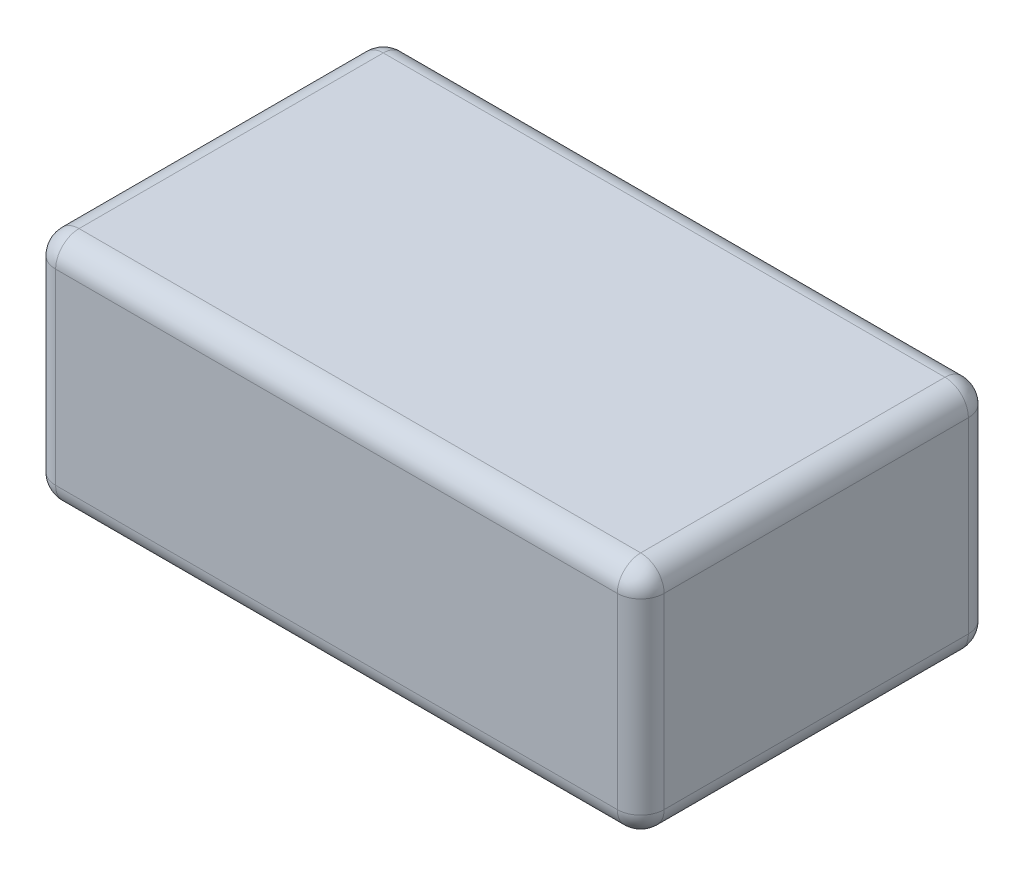
ISO-10303-21;
HEADER;
FILE_DESCRIPTION(('STEP AP214'),'2;1');
FILE_NAME('part.step','',(''),(''),'','','');
FILE_SCHEMA(('AUTOMOTIVE_DESIGN { 1 0 10303 214 1 1 1 1 }'));
ENDSEC;
DATA;
#1=APPLICATION_CONTEXT('core data for automotive mechanical design processes');
#2=APPLICATION_PROTOCOL_DEFINITION('international standard','automotive_design',2000,#1);
#3=PRODUCT_CONTEXT('',#1,'mechanical');
#4=PRODUCT('Part','Part','',(#3));
#5=PRODUCT_RELATED_PRODUCT_CATEGORY('part','',(#4));
#6=PRODUCT_DEFINITION_FORMATION('','',#4);
#7=PRODUCT_DEFINITION_CONTEXT('part definition',#1,'design');
#8=PRODUCT_DEFINITION('design','',#6,#7);
#9=PRODUCT_DEFINITION_SHAPE('','',#8);
#10=(LENGTH_UNIT() NAMED_UNIT(*) SI_UNIT(.MILLI.,.METRE.));
#11=(NAMED_UNIT(*) PLANE_ANGLE_UNIT() SI_UNIT($,.RADIAN.));
#12=(NAMED_UNIT(*) SI_UNIT($,.STERADIAN.) SOLID_ANGLE_UNIT());
#13=UNCERTAINTY_MEASURE_WITH_UNIT(LENGTH_MEASURE(1.E-05),#10,'distance_accuracy_value','');
#14=(GEOMETRIC_REPRESENTATION_CONTEXT(3) GLOBAL_UNCERTAINTY_ASSIGNED_CONTEXT((#13)) GLOBAL_UNIT_ASSIGNED_CONTEXT((#10,
#11,#12)) REPRESENTATION_CONTEXT('',''));
#15=CARTESIAN_POINT('',(0.,0.,0.));
#16=DIRECTION('',(0.,0.,1.));
#17=DIRECTION('',(1.,0.,0.));
#18=AXIS2_PLACEMENT_3D('',#15,#16,#17);
#19=CARTESIAN_POINT('',(26.,20.,15.));
#20=DIRECTION('',(-1.,0.,0.));
#21=DIRECTION('',(0.,0.,1.));
#22=AXIS2_PLACEMENT_3D('',#19,#20,#21);
#23=PLANE('',#22);
#24=DIRECTION('',(0.,0.,-1.));
#25=VECTOR('',#24,1.);
#26=CARTESIAN_POINT('',(26.,18.,15.));
#27=LINE('',#26,#25);
#28=CARTESIAN_POINT('',(26.,18.,-13.));
#29=VERTEX_POINT('',#28);
#30=CARTESIAN_POINT('',(26.,18.,13.));
#31=VERTEX_POINT('',#30);
#32=EDGE_CURVE('E178',#29,#31,#27,.F.);
#33=ORIENTED_EDGE('',*,*,#32,.T.);
#34=DIRECTION('',(0.,-1.,0.));
#35=VECTOR('',#34,1.);
#36=CARTESIAN_POINT('',(26.,20.,13.));
#37=LINE('',#36,#35);
#38=CARTESIAN_POINT('',(26.,2.,13.));
#39=VERTEX_POINT('',#38);
#40=EDGE_CURVE('E183',#31,#39,#37,.T.);
#41=ORIENTED_EDGE('',*,*,#40,.T.);
#42=DIRECTION('',(0.,0.,-1.));
#43=VECTOR('',#42,1.);
#44=CARTESIAN_POINT('',(26.,2.,-15.));
#45=LINE('',#44,#43);
#46=CARTESIAN_POINT('',(26.,2.,-13.));
#47=VERTEX_POINT('',#46);
#48=EDGE_CURVE('E180',#39,#47,#45,.T.);
#49=ORIENTED_EDGE('',*,*,#48,.T.);
#50=DIRECTION('',(0.,-1.,0.));
#51=VECTOR('',#50,1.);
#52=CARTESIAN_POINT('',(26.,20.,-13.));
#53=LINE('',#52,#51);
#54=EDGE_CURVE('E176',#47,#29,#53,.F.);
#55=ORIENTED_EDGE('',*,*,#54,.T.);
#56=EDGE_LOOP('',(#33,#41,#49,#55));
#57=FACE_BOUND('',#56,.T.);
#58=ADVANCED_FACE('F33',(#57),#23,.F.);
#59=CARTESIAN_POINT('',(-26.,20.,-15.));
#60=DIRECTION('',(0.,0.,1.));
#61=DIRECTION('',(1.,0.,0.));
#62=AXIS2_PLACEMENT_3D('',#59,#60,#61);
#63=PLANE('',#62);
#64=DIRECTION('',(0.,-1.,0.));
#65=VECTOR('',#64,1.);
#66=CARTESIAN_POINT('',(24.,20.,-15.));
#67=LINE('',#66,#65);
#68=CARTESIAN_POINT('',(24.,18.,-15.));
#69=VERTEX_POINT('',#68);
#70=CARTESIAN_POINT('',(24.,2.,-15.));
#71=VERTEX_POINT('',#70);
#72=EDGE_CURVE('E128',#69,#71,#67,.T.);
#73=ORIENTED_EDGE('',*,*,#72,.T.);
#74=DIRECTION('',(-1.,0.,0.));
#75=VECTOR('',#74,1.);
#76=CARTESIAN_POINT('',(-26.,2.,-15.));
#77=LINE('',#76,#75);
#78=CARTESIAN_POINT('',(-24.,2.,-15.));
#79=VERTEX_POINT('',#78);
#80=EDGE_CURVE('E156',#71,#79,#77,.T.);
#81=ORIENTED_EDGE('',*,*,#80,.T.);
#82=DIRECTION('',(0.,-1.,0.));
#83=VECTOR('',#82,1.);
#84=CARTESIAN_POINT('',(-24.,20.,-15.));
#85=LINE('',#84,#83);
#86=CARTESIAN_POINT('',(-24.,18.,-15.));
#87=VERTEX_POINT('',#86);
#88=EDGE_CURVE('E131',#79,#87,#85,.F.);
#89=ORIENTED_EDGE('',*,*,#88,.T.);
#90=DIRECTION('',(-1.,0.,0.));
#91=VECTOR('',#90,1.);
#92=CARTESIAN_POINT('',(-26.,18.,-15.));
#93=LINE('',#92,#91);
#94=EDGE_CURVE('E124',#87,#69,#93,.F.);
#95=ORIENTED_EDGE('',*,*,#94,.T.);
#96=EDGE_LOOP('',(#73,#81,#89,#95));
#97=FACE_BOUND('',#96,.T.);
#98=ADVANCED_FACE('F125',(#97),#63,.F.);
#99=CARTESIAN_POINT('',(-26.,20.,15.));
#100=DIRECTION('',(1.,0.,0.));
#101=DIRECTION('',(0.,0.,-1.));
#102=AXIS2_PLACEMENT_3D('',#99,#100,#101);
#103=PLANE('',#102);
#104=DIRECTION('',(0.,0.,1.));
#105=VECTOR('',#104,1.);
#106=CARTESIAN_POINT('',(-26.,18.,15.));
#107=LINE('',#106,#105);
#108=CARTESIAN_POINT('',(-26.,18.,13.));
#109=VERTEX_POINT('',#108);
#110=CARTESIAN_POINT('',(-26.,18.,-13.));
#111=VERTEX_POINT('',#110);
#112=EDGE_CURVE('E169',#109,#111,#107,.F.);
#113=ORIENTED_EDGE('',*,*,#112,.T.);
#114=DIRECTION('',(0.,-1.,0.));
#115=VECTOR('',#114,1.);
#116=CARTESIAN_POINT('',(-26.,20.,-13.));
#117=LINE('',#116,#115);
#118=CARTESIAN_POINT('',(-26.,2.,-13.));
#119=VERTEX_POINT('',#118);
#120=EDGE_CURVE('E173',#111,#119,#117,.T.);
#121=ORIENTED_EDGE('',*,*,#120,.T.);
#122=DIRECTION('',(0.,0.,1.));
#123=VECTOR('',#122,1.);
#124=CARTESIAN_POINT('',(-26.,2.,15.));
#125=LINE('',#124,#123);
#126=CARTESIAN_POINT('',(-26.,2.,13.));
#127=VERTEX_POINT('',#126);
#128=EDGE_CURVE('E171',#119,#127,#125,.T.);
#129=ORIENTED_EDGE('',*,*,#128,.T.);
#130=DIRECTION('',(0.,-1.,0.));
#131=VECTOR('',#130,1.);
#132=CARTESIAN_POINT('',(-26.,20.,13.));
#133=LINE('',#132,#131);
#134=EDGE_CURVE('E167',#127,#109,#133,.F.);
#135=ORIENTED_EDGE('',*,*,#134,.T.);
#136=EDGE_LOOP('',(#113,#121,#129,#135));
#137=FACE_BOUND('',#136,.T.);
#138=ADVANCED_FACE('F262',(#137),#103,.F.);
#139=CARTESIAN_POINT('',(-26.,20.,15.));
#140=DIRECTION('',(0.,0.,-1.));
#141=DIRECTION('',(-1.,0.,0.));
#142=AXIS2_PLACEMENT_3D('',#139,#140,#141);
#143=PLANE('',#142);
#144=DIRECTION('',(1.,0.,0.));
#145=VECTOR('',#144,1.);
#146=CARTESIAN_POINT('',(26.,2.,15.));
#147=LINE('',#146,#145);
#148=CARTESIAN_POINT('',(-24.,2.,15.));
#149=VERTEX_POINT('',#148);
#150=CARTESIAN_POINT('',(24.,2.,15.));
#151=VERTEX_POINT('',#150);
#152=EDGE_CURVE('E189',#149,#151,#147,.T.);
#153=ORIENTED_EDGE('',*,*,#152,.T.);
#154=DIRECTION('',(0.,-1.,0.));
#155=VECTOR('',#154,1.);
#156=CARTESIAN_POINT('',(24.,20.,15.));
#157=LINE('',#156,#155);
#158=CARTESIAN_POINT('',(24.,18.,15.));
#159=VERTEX_POINT('',#158);
#160=EDGE_CURVE('E192',#151,#159,#157,.F.);
#161=ORIENTED_EDGE('',*,*,#160,.T.);
#162=DIRECTION('',(1.,0.,0.));
#163=VECTOR('',#162,1.);
#164=CARTESIAN_POINT('',(-26.,18.,15.));
#165=LINE('',#164,#163);
#166=CARTESIAN_POINT('',(-24.,18.,15.));
#167=VERTEX_POINT('',#166);
#168=EDGE_CURVE('E187',#159,#167,#165,.F.);
#169=ORIENTED_EDGE('',*,*,#168,.T.);
#170=DIRECTION('',(0.,-1.,0.));
#171=VECTOR('',#170,1.);
#172=CARTESIAN_POINT('',(-24.,20.,15.));
#173=LINE('',#172,#171);
#174=EDGE_CURVE('E185',#167,#149,#173,.T.);
#175=ORIENTED_EDGE('',*,*,#174,.T.);
#176=EDGE_LOOP('',(#153,#161,#169,#175));
#177=FACE_BOUND('',#176,.T.);
#178=ADVANCED_FACE('F271',(#177),#143,.F.);
#179=CARTESIAN_POINT('',(0.,20.,0.));
#180=DIRECTION('',(0.,-1.,0.));
#181=DIRECTION('',(0.,0.,-1.));
#182=AXIS2_PLACEMENT_3D('',#179,#180,#181);
#183=PLANE('',#182);
#184=DIRECTION('',(1.,0.,0.));
#185=VECTOR('',#184,1.);
#186=CARTESIAN_POINT('',(0.,20.,13.));
#187=LINE('',#186,#185);
#188=CARTESIAN_POINT('',(-24.,20.,13.));
#189=VERTEX_POINT('',#188);
#190=CARTESIAN_POINT('',(24.,20.,13.));
#191=VERTEX_POINT('',#190);
#192=EDGE_CURVE('E194',#189,#191,#187,.T.);
#193=ORIENTED_EDGE('',*,*,#192,.T.);
#194=DIRECTION('',(0.,0.,-1.));
#195=VECTOR('',#194,1.);
#196=CARTESIAN_POINT('',(24.,20.,0.));
#197=LINE('',#196,#195);
#198=CARTESIAN_POINT('',(24.,20.,-13.));
#199=VERTEX_POINT('',#198);
#200=EDGE_CURVE('E11',#191,#199,#197,.T.);
#201=ORIENTED_EDGE('',*,*,#200,.T.);
#202=DIRECTION('',(-1.,0.,0.));
#203=VECTOR('',#202,1.);
#204=CARTESIAN_POINT('',(0.,20.,-13.));
#205=LINE('',#204,#203);
#206=CARTESIAN_POINT('',(-24.,20.,-13.));
#207=VERTEX_POINT('',#206);
#208=EDGE_CURVE('E42',#199,#207,#205,.T.);
#209=ORIENTED_EDGE('',*,*,#208,.T.);
#210=DIRECTION('',(0.,0.,1.));
#211=VECTOR('',#210,1.);
#212=CARTESIAN_POINT('',(-24.,20.,0.));
#213=LINE('',#212,#211);
#214=EDGE_CURVE('E196',#207,#189,#213,.T.);
#215=ORIENTED_EDGE('',*,*,#214,.T.);
#216=EDGE_LOOP('',(#193,#201,#209,#215));
#217=FACE_BOUND('',#216,.T.);
#218=ADVANCED_FACE('F294',(#217),#183,.F.);
#219=CARTESIAN_POINT('',(0.,0.,0.));
#220=DIRECTION('',(0.,-1.,0.));
#221=DIRECTION('',(0.,0.,-1.));
#222=AXIS2_PLACEMENT_3D('',#219,#220,#221);
#223=PLANE('',#222);
#224=DIRECTION('',(0.,0.,1.));
#225=VECTOR('',#224,1.);
#226=CARTESIAN_POINT('',(-24.,0.,-15.));
#227=LINE('',#226,#225);
#228=CARTESIAN_POINT('',(-24.,0.,13.));
#229=VERTEX_POINT('',#228);
#230=CARTESIAN_POINT('',(-24.,0.,-13.));
#231=VERTEX_POINT('',#230);
#232=EDGE_CURVE('E162',#229,#231,#227,.F.);
#233=ORIENTED_EDGE('',*,*,#232,.T.);
#234=DIRECTION('',(-1.,0.,0.));
#235=VECTOR('',#234,1.);
#236=CARTESIAN_POINT('',(26.,0.,-13.));
#237=LINE('',#236,#235);
#238=CARTESIAN_POINT('',(24.,0.,-13.));
#239=VERTEX_POINT('',#238);
#240=EDGE_CURVE('E164',#231,#239,#237,.F.);
#241=ORIENTED_EDGE('',*,*,#240,.T.);
#242=DIRECTION('',(0.,0.,-1.));
#243=VECTOR('',#242,1.);
#244=CARTESIAN_POINT('',(24.,0.,15.));
#245=LINE('',#244,#243);
#246=CARTESIAN_POINT('',(24.,0.,13.));
#247=VERTEX_POINT('',#246);
#248=EDGE_CURVE('E160',#239,#247,#245,.F.);
#249=ORIENTED_EDGE('',*,*,#248,.T.);
#250=DIRECTION('',(1.,0.,0.));
#251=VECTOR('',#250,1.);
#252=CARTESIAN_POINT('',(-26.,0.,13.));
#253=LINE('',#252,#251);
#254=EDGE_CURVE('E158',#247,#229,#253,.F.);
#255=ORIENTED_EDGE('',*,*,#254,.T.);
#256=EDGE_LOOP('',(#233,#241,#249,#255));
#257=FACE_BOUND('',#256,.T.);
#258=ADVANCED_FACE('F296',(#257),#223,.T.);
#259=CARTESIAN_POINT('',(0.,18.,13.));
#260=DIRECTION('',(1.,0.,0.));
#261=DIRECTION('',(0.,0.,-1.));
#262=AXIS2_PLACEMENT_3D('',#259,#260,#261);
#263=CYLINDRICAL_SURFACE('',#262,2.);
#264=CARTESIAN_POINT('',(24.,18.,13.));
#265=DIRECTION('',(1.,0.,0.));
#266=DIRECTION('',(0.,0.,-1.));
#267=AXIS2_PLACEMENT_3D('',#264,#265,#266);
#268=CIRCLE('',#267,2.);
#269=EDGE_CURVE('E37',#191,#159,#268,.T.);
#270=ORIENTED_EDGE('',*,*,#269,.F.);
#271=ORIENTED_EDGE('',*,*,#192,.F.);
#272=CARTESIAN_POINT('',(-24.,18.,13.));
#273=DIRECTION('',(-1.,0.,0.));
#274=DIRECTION('',(0.,0.,1.));
#275=AXIS2_PLACEMENT_3D('',#272,#273,#274);
#276=CIRCLE('',#275,2.);
#277=EDGE_CURVE('E153',#167,#189,#276,.T.);
#278=ORIENTED_EDGE('',*,*,#277,.F.);
#279=ORIENTED_EDGE('',*,*,#168,.F.);
#280=EDGE_LOOP('',(#270,#271,#278,#279));
#281=FACE_BOUND('',#280,.T.);
#282=ADVANCED_FACE('F35',(#281),#263,.T.);
#283=CARTESIAN_POINT('',(24.,18.,13.));
#284=DIRECTION('',(0.,0.,1.));
#285=DIRECTION('',(1.,0.,0.));
#286=AXIS2_PLACEMENT_3D('',#283,#284,#285);
#287=SPHERICAL_SURFACE('',#286,2.);
#288=CARTESIAN_POINT('',(24.,18.,13.));
#289=DIRECTION('',(0.,0.,1.));
#290=DIRECTION('',(1.,0.,0.));
#291=AXIS2_PLACEMENT_3D('',#288,#289,#290);
#292=CIRCLE('',#291,2.);
#293=EDGE_CURVE('E241',#191,#31,#292,.F.);
#294=ORIENTED_EDGE('',*,*,#293,.F.);
#295=ORIENTED_EDGE('',*,*,#269,.T.);
#296=CARTESIAN_POINT('',(24.,18.,13.));
#297=DIRECTION('',(0.,1.,0.));
#298=DIRECTION('',(0.,0.,1.));
#299=AXIS2_PLACEMENT_3D('',#296,#297,#298);
#300=CIRCLE('',#299,2.);
#301=EDGE_CURVE('E244',#31,#159,#300,.F.);
#302=ORIENTED_EDGE('',*,*,#301,.F.);
#303=EDGE_LOOP('',(#294,#295,#302));
#304=FACE_BOUND('',#303,.T.);
#305=ADVANCED_FACE('F289',(#304),#287,.T.);
#306=CARTESIAN_POINT('',(-24.,18.,13.));
#307=DIRECTION('',(0.,0.,1.));
#308=DIRECTION('',(1.,0.,0.));
#309=AXIS2_PLACEMENT_3D('',#306,#307,#308);
#310=SPHERICAL_SURFACE('',#309,2.);
#311=CARTESIAN_POINT('',(-24.,18.,13.));
#312=DIRECTION('',(0.,1.,0.));
#313=DIRECTION('',(0.,0.,1.));
#314=AXIS2_PLACEMENT_3D('',#311,#312,#313);
#315=CIRCLE('',#314,2.);
#316=EDGE_CURVE('E235',#167,#109,#315,.F.);
#317=ORIENTED_EDGE('',*,*,#316,.F.);
#318=ORIENTED_EDGE('',*,*,#277,.T.);
#319=CARTESIAN_POINT('',(-24.,18.,13.));
#320=DIRECTION('',(0.,0.,1.));
#321=DIRECTION('',(1.,0.,0.));
#322=AXIS2_PLACEMENT_3D('',#319,#320,#321);
#323=CIRCLE('',#322,2.);
#324=EDGE_CURVE('E238',#109,#189,#323,.F.);
#325=ORIENTED_EDGE('',*,*,#324,.F.);
#326=EDGE_LOOP('',(#317,#318,#325));
#327=FACE_BOUND('',#326,.T.);
#328=ADVANCED_FACE('F251',(#327),#310,.T.);
#329=CARTESIAN_POINT('',(24.,20.,13.));
#330=DIRECTION('',(0.,-1.,0.));
#331=DIRECTION('',(0.,0.,-1.));
#332=AXIS2_PLACEMENT_3D('',#329,#330,#331);
#333=CYLINDRICAL_SURFACE('',#332,2.);
#334=ORIENTED_EDGE('',*,*,#301,.T.);
#335=ORIENTED_EDGE('',*,*,#160,.F.);
#336=CARTESIAN_POINT('',(24.,2.,13.));
#337=DIRECTION('',(0.,-1.,0.));
#338=DIRECTION('',(0.,0.,-1.));
#339=AXIS2_PLACEMENT_3D('',#336,#337,#338);
#340=CIRCLE('',#339,2.);
#341=EDGE_CURVE('E230',#39,#151,#340,.T.);
#342=ORIENTED_EDGE('',*,*,#341,.F.);
#343=ORIENTED_EDGE('',*,*,#40,.F.);
#344=EDGE_LOOP('',(#334,#335,#342,#343));
#345=FACE_BOUND('',#344,.T.);
#346=ADVANCED_FACE('F283',(#345),#333,.T.);
#347=CARTESIAN_POINT('',(24.,18.,0.));
#348=DIRECTION('',(0.,0.,-1.));
#349=DIRECTION('',(-1.,0.,0.));
#350=AXIS2_PLACEMENT_3D('',#347,#348,#349);
#351=CYLINDRICAL_SURFACE('',#350,2.);
#352=ORIENTED_EDGE('',*,*,#293,.T.);
#353=ORIENTED_EDGE('',*,*,#32,.F.);
#354=CARTESIAN_POINT('',(24.,18.,-13.));
#355=DIRECTION('',(0.,0.,-1.));
#356=DIRECTION('',(-1.,0.,0.));
#357=AXIS2_PLACEMENT_3D('',#354,#355,#356);
#358=CIRCLE('',#357,2.);
#359=EDGE_CURVE('E137',#199,#29,#358,.T.);
#360=ORIENTED_EDGE('',*,*,#359,.F.);
#361=ORIENTED_EDGE('',*,*,#200,.F.);
#362=EDGE_LOOP('',(#352,#353,#360,#361));
#363=FACE_BOUND('',#362,.T.);
#364=ADVANCED_FACE('F293',(#363),#351,.T.);
#365=CARTESIAN_POINT('',(0.,18.,-13.));
#366=DIRECTION('',(-1.,0.,0.));
#367=DIRECTION('',(0.,0.,1.));
#368=AXIS2_PLACEMENT_3D('',#365,#366,#367);
#369=CYLINDRICAL_SURFACE('',#368,2.);
#370=CARTESIAN_POINT('',(-24.,18.,-13.));
#371=DIRECTION('',(-1.,0.,0.));
#372=DIRECTION('',(0.,0.,1.));
#373=AXIS2_PLACEMENT_3D('',#370,#371,#372);
#374=CIRCLE('',#373,2.);
#375=EDGE_CURVE('E138',#207,#87,#374,.T.);
#376=ORIENTED_EDGE('',*,*,#375,.F.);
#377=ORIENTED_EDGE('',*,*,#208,.F.);
#378=CARTESIAN_POINT('',(24.,18.,-13.));
#379=DIRECTION('',(1.,0.,0.));
#380=DIRECTION('',(0.,1.,0.));
#381=AXIS2_PLACEMENT_3D('',#378,#379,#380);
#382=CIRCLE('',#381,2.);
#383=EDGE_CURVE('E50',#69,#199,#382,.T.);
#384=ORIENTED_EDGE('',*,*,#383,.F.);
#385=ORIENTED_EDGE('',*,*,#94,.F.);
#386=EDGE_LOOP('',(#376,#377,#384,#385));
#387=FACE_BOUND('',#386,.T.);
#388=ADVANCED_FACE('F136',(#387),#369,.T.);
#389=CARTESIAN_POINT('',(-24.,18.,0.));
#390=DIRECTION('',(0.,0.,1.));
#391=DIRECTION('',(1.,0.,0.));
#392=AXIS2_PLACEMENT_3D('',#389,#390,#391);
#393=CYLINDRICAL_SURFACE('',#392,2.);
#394=ORIENTED_EDGE('',*,*,#324,.T.);
#395=ORIENTED_EDGE('',*,*,#214,.F.);
#396=CARTESIAN_POINT('',(-24.,18.,-13.));
#397=DIRECTION('',(0.,0.,-1.));
#398=DIRECTION('',(0.,1.,0.));
#399=AXIS2_PLACEMENT_3D('',#396,#397,#398);
#400=CIRCLE('',#399,2.);
#401=EDGE_CURVE('E225',#111,#207,#400,.T.);
#402=ORIENTED_EDGE('',*,*,#401,.F.);
#403=ORIENTED_EDGE('',*,*,#112,.F.);
#404=EDGE_LOOP('',(#394,#395,#402,#403));
#405=FACE_BOUND('',#404,.T.);
#406=ADVANCED_FACE('F258',(#405),#393,.T.);
#407=CARTESIAN_POINT('',(-24.,20.,13.));
#408=DIRECTION('',(0.,-1.,0.));
#409=DIRECTION('',(0.,0.,-1.));
#410=AXIS2_PLACEMENT_3D('',#407,#408,#409);
#411=CYLINDRICAL_SURFACE('',#410,2.);
#412=ORIENTED_EDGE('',*,*,#316,.T.);
#413=ORIENTED_EDGE('',*,*,#134,.F.);
#414=CARTESIAN_POINT('',(-24.,2.,13.));
#415=DIRECTION('',(0.,-1.,0.));
#416=DIRECTION('',(0.,0.,-1.));
#417=AXIS2_PLACEMENT_3D('',#414,#415,#416);
#418=CIRCLE('',#417,2.);
#419=EDGE_CURVE('E222',#149,#127,#418,.T.);
#420=ORIENTED_EDGE('',*,*,#419,.F.);
#421=ORIENTED_EDGE('',*,*,#174,.F.);
#422=EDGE_LOOP('',(#412,#413,#420,#421));
#423=FACE_BOUND('',#422,.T.);
#424=ADVANCED_FACE('F268',(#423),#411,.T.);
#425=CARTESIAN_POINT('',(-26.,2.,13.));
#426=DIRECTION('',(-1.,0.,0.));
#427=DIRECTION('',(0.,0.,1.));
#428=AXIS2_PLACEMENT_3D('',#425,#426,#427);
#429=CYLINDRICAL_SURFACE('',#428,2.);
#430=CARTESIAN_POINT('',(24.,2.,13.));
#431=DIRECTION('',(1.,0.,0.));
#432=DIRECTION('',(0.,0.,-1.));
#433=AXIS2_PLACEMENT_3D('',#430,#431,#432);
#434=CIRCLE('',#433,2.);
#435=EDGE_CURVE('E232',#151,#247,#434,.T.);
#436=ORIENTED_EDGE('',*,*,#435,.F.);
#437=ORIENTED_EDGE('',*,*,#152,.F.);
#438=CARTESIAN_POINT('',(-24.,2.,13.));
#439=DIRECTION('',(-1.,0.,0.));
#440=DIRECTION('',(0.,0.,1.));
#441=AXIS2_PLACEMENT_3D('',#438,#439,#440);
#442=CIRCLE('',#441,2.);
#443=EDGE_CURVE('E219',#229,#149,#442,.T.);
#444=ORIENTED_EDGE('',*,*,#443,.F.);
#445=ORIENTED_EDGE('',*,*,#254,.F.);
#446=EDGE_LOOP('',(#436,#437,#444,#445));
#447=FACE_BOUND('',#446,.T.);
#448=ADVANCED_FACE('F275',(#447),#429,.T.);
#449=CARTESIAN_POINT('',(24.,2.,13.));
#450=DIRECTION('',(0.,0.,1.));
#451=DIRECTION('',(1.,0.,0.));
#452=AXIS2_PLACEMENT_3D('',#449,#450,#451);
#453=SPHERICAL_SURFACE('',#452,2.);
#454=ORIENTED_EDGE('',*,*,#341,.T.);
#455=ORIENTED_EDGE('',*,*,#435,.T.);
#456=CARTESIAN_POINT('',(24.,2.,13.));
#457=DIRECTION('',(0.,0.,1.));
#458=DIRECTION('',(1.,0.,0.));
#459=AXIS2_PLACEMENT_3D('',#456,#457,#458);
#460=CIRCLE('',#459,2.);
#461=EDGE_CURVE('E145',#39,#247,#460,.F.);
#462=ORIENTED_EDGE('',*,*,#461,.F.);
#463=EDGE_LOOP('',(#454,#455,#462));
#464=FACE_BOUND('',#463,.T.);
#465=ADVANCED_FACE('F350',(#464),#453,.T.);
#466=CARTESIAN_POINT('',(24.,18.,-13.));
#467=DIRECTION('',(0.,0.,1.));
#468=DIRECTION('',(1.,0.,0.));
#469=AXIS2_PLACEMENT_3D('',#466,#467,#468);
#470=SPHERICAL_SURFACE('',#469,2.);
#471=ORIENTED_EDGE('',*,*,#383,.T.);
#472=ORIENTED_EDGE('',*,*,#359,.T.);
#473=CARTESIAN_POINT('',(24.,18.,-13.));
#474=DIRECTION('',(0.,1.,0.));
#475=DIRECTION('',(0.,0.,1.));
#476=AXIS2_PLACEMENT_3D('',#473,#474,#475);
#477=CIRCLE('',#476,2.);
#478=EDGE_CURVE('E141',#69,#29,#477,.F.);
#479=ORIENTED_EDGE('',*,*,#478,.F.);
#480=EDGE_LOOP('',(#471,#472,#479));
#481=FACE_BOUND('',#480,.T.);
#482=ADVANCED_FACE('F142',(#481),#470,.T.);
#483=CARTESIAN_POINT('',(-24.,18.,-13.));
#484=DIRECTION('',(0.,0.,1.));
#485=DIRECTION('',(1.,0.,0.));
#486=AXIS2_PLACEMENT_3D('',#483,#484,#485);
#487=SPHERICAL_SURFACE('',#486,2.);
#488=ORIENTED_EDGE('',*,*,#401,.T.);
#489=ORIENTED_EDGE('',*,*,#375,.T.);
#490=CARTESIAN_POINT('',(-24.,18.,-13.));
#491=DIRECTION('',(0.,1.,0.));
#492=DIRECTION('',(0.,0.,1.));
#493=AXIS2_PLACEMENT_3D('',#490,#491,#492);
#494=CIRCLE('',#493,2.);
#495=EDGE_CURVE('E146',#111,#87,#494,.F.);
#496=ORIENTED_EDGE('',*,*,#495,.F.);
#497=EDGE_LOOP('',(#488,#489,#496));
#498=FACE_BOUND('',#497,.T.);
#499=ADVANCED_FACE('F343',(#498),#487,.T.);
#500=CARTESIAN_POINT('',(-24.,2.,13.));
#501=DIRECTION('',(0.,0.,1.));
#502=DIRECTION('',(1.,0.,0.));
#503=AXIS2_PLACEMENT_3D('',#500,#501,#502);
#504=SPHERICAL_SURFACE('',#503,2.);
#505=ORIENTED_EDGE('',*,*,#443,.T.);
#506=ORIENTED_EDGE('',*,*,#419,.T.);
#507=CARTESIAN_POINT('',(-24.,2.,13.));
#508=DIRECTION('',(0.,0.,1.));
#509=DIRECTION('',(1.,0.,0.));
#510=AXIS2_PLACEMENT_3D('',#507,#508,#509);
#511=CIRCLE('',#510,2.);
#512=EDGE_CURVE('E212',#229,#127,#511,.F.);
#513=ORIENTED_EDGE('',*,*,#512,.F.);
#514=EDGE_LOOP('',(#505,#506,#513));
#515=FACE_BOUND('',#514,.T.);
#516=ADVANCED_FACE('F339',(#515),#504,.T.);
#517=CARTESIAN_POINT('',(24.,2.,15.));
#518=DIRECTION('',(0.,0.,1.));
#519=DIRECTION('',(1.,0.,0.));
#520=AXIS2_PLACEMENT_3D('',#517,#518,#519);
#521=CYLINDRICAL_SURFACE('',#520,2.);
#522=ORIENTED_EDGE('',*,*,#461,.T.);
#523=ORIENTED_EDGE('',*,*,#248,.F.);
#524=CARTESIAN_POINT('',(24.,2.,-13.));
#525=DIRECTION('',(0.,0.,-1.));
#526=DIRECTION('',(-1.,0.,0.));
#527=AXIS2_PLACEMENT_3D('',#524,#525,#526);
#528=CIRCLE('',#527,2.);
#529=EDGE_CURVE('E209',#47,#239,#528,.T.);
#530=ORIENTED_EDGE('',*,*,#529,.F.);
#531=ORIENTED_EDGE('',*,*,#48,.F.);
#532=EDGE_LOOP('',(#522,#523,#530,#531));
#533=FACE_BOUND('',#532,.T.);
#534=ADVANCED_FACE('F336',(#533),#521,.T.);
#535=CARTESIAN_POINT('',(24.,20.,-13.));
#536=DIRECTION('',(0.,-1.,0.));
#537=DIRECTION('',(0.,0.,-1.));
#538=AXIS2_PLACEMENT_3D('',#535,#536,#537);
#539=CYLINDRICAL_SURFACE('',#538,2.);
#540=ORIENTED_EDGE('',*,*,#478,.T.);
#541=ORIENTED_EDGE('',*,*,#54,.F.);
#542=CARTESIAN_POINT('',(24.,2.,-13.));
#543=DIRECTION('',(0.,-1.,0.));
#544=DIRECTION('',(0.,0.,-1.));
#545=AXIS2_PLACEMENT_3D('',#542,#543,#544);
#546=CIRCLE('',#545,2.);
#547=EDGE_CURVE('E149',#71,#47,#546,.T.);
#548=ORIENTED_EDGE('',*,*,#547,.F.);
#549=ORIENTED_EDGE('',*,*,#72,.F.);
#550=EDGE_LOOP('',(#540,#541,#548,#549));
#551=FACE_BOUND('',#550,.T.);
#552=ADVANCED_FACE('F148',(#551),#539,.T.);
#553=CARTESIAN_POINT('',(-24.,20.,-13.));
#554=DIRECTION('',(0.,-1.,0.));
#555=DIRECTION('',(0.,0.,-1.));
#556=AXIS2_PLACEMENT_3D('',#553,#554,#555);
#557=CYLINDRICAL_SURFACE('',#556,2.);
#558=ORIENTED_EDGE('',*,*,#495,.T.);
#559=ORIENTED_EDGE('',*,*,#88,.F.);
#560=CARTESIAN_POINT('',(-24.,2.,-13.));
#561=DIRECTION('',(0.,-1.,0.));
#562=DIRECTION('',(0.,0.,-1.));
#563=AXIS2_PLACEMENT_3D('',#560,#561,#562);
#564=CIRCLE('',#563,2.);
#565=EDGE_CURVE('E205',#119,#79,#564,.T.);
#566=ORIENTED_EDGE('',*,*,#565,.F.);
#567=ORIENTED_EDGE('',*,*,#120,.F.);
#568=EDGE_LOOP('',(#558,#559,#566,#567));
#569=FACE_BOUND('',#568,.T.);
#570=ADVANCED_FACE('F329',(#569),#557,.T.);
#571=CARTESIAN_POINT('',(-24.,2.,15.));
#572=DIRECTION('',(0.,0.,-1.));
#573=DIRECTION('',(-1.,0.,0.));
#574=AXIS2_PLACEMENT_3D('',#571,#572,#573);
#575=CYLINDRICAL_SURFACE('',#574,2.);
#576=ORIENTED_EDGE('',*,*,#512,.T.);
#577=ORIENTED_EDGE('',*,*,#128,.F.);
#578=CARTESIAN_POINT('',(-24.,2.,-13.));
#579=DIRECTION('',(0.,0.,-1.));
#580=DIRECTION('',(-1.,0.,0.));
#581=AXIS2_PLACEMENT_3D('',#578,#579,#580);
#582=CIRCLE('',#581,2.);
#583=EDGE_CURVE('E203',#231,#119,#582,.T.);
#584=ORIENTED_EDGE('',*,*,#583,.F.);
#585=ORIENTED_EDGE('',*,*,#232,.F.);
#586=EDGE_LOOP('',(#576,#577,#584,#585));
#587=FACE_BOUND('',#586,.T.);
#588=ADVANCED_FACE('F325',(#587),#575,.T.);
#589=CARTESIAN_POINT('',(24.,2.,-13.));
#590=DIRECTION('',(0.,0.,1.));
#591=DIRECTION('',(1.,0.,0.));
#592=AXIS2_PLACEMENT_3D('',#589,#590,#591);
#593=SPHERICAL_SURFACE('',#592,2.);
#594=ORIENTED_EDGE('',*,*,#547,.T.);
#595=ORIENTED_EDGE('',*,*,#529,.T.);
#596=CARTESIAN_POINT('',(24.,2.,-13.));
#597=DIRECTION('',(1.,0.,0.));
#598=DIRECTION('',(0.,0.,-1.));
#599=AXIS2_PLACEMENT_3D('',#596,#597,#598);
#600=CIRCLE('',#599,2.);
#601=EDGE_CURVE('E201',#71,#239,#600,.F.);
#602=ORIENTED_EDGE('',*,*,#601,.F.);
#603=EDGE_LOOP('',(#594,#595,#602));
#604=FACE_BOUND('',#603,.T.);
#605=ADVANCED_FACE('F321',(#604),#593,.T.);
#606=CARTESIAN_POINT('',(-24.,2.,-13.));
#607=DIRECTION('',(0.,0.,1.));
#608=DIRECTION('',(1.,0.,0.));
#609=AXIS2_PLACEMENT_3D('',#606,#607,#608);
#610=SPHERICAL_SURFACE('',#609,2.);
#611=ORIENTED_EDGE('',*,*,#583,.T.);
#612=ORIENTED_EDGE('',*,*,#565,.T.);
#613=CARTESIAN_POINT('',(-24.,2.,-13.));
#614=DIRECTION('',(-1.,0.,0.));
#615=DIRECTION('',(0.,0.,1.));
#616=AXIS2_PLACEMENT_3D('',#613,#614,#615);
#617=CIRCLE('',#616,2.);
#618=EDGE_CURVE('E199',#231,#79,#617,.F.);
#619=ORIENTED_EDGE('',*,*,#618,.F.);
#620=EDGE_LOOP('',(#611,#612,#619));
#621=FACE_BOUND('',#620,.T.);
#622=ADVANCED_FACE('F317',(#621),#610,.T.);
#623=CARTESIAN_POINT('',(-26.,2.,-13.));
#624=DIRECTION('',(1.,0.,0.));
#625=DIRECTION('',(0.,0.,-1.));
#626=AXIS2_PLACEMENT_3D('',#623,#624,#625);
#627=CYLINDRICAL_SURFACE('',#626,2.);
#628=ORIENTED_EDGE('',*,*,#601,.T.);
#629=ORIENTED_EDGE('',*,*,#240,.F.);
#630=ORIENTED_EDGE('',*,*,#618,.T.);
#631=ORIENTED_EDGE('',*,*,#80,.F.);
#632=EDGE_LOOP('',(#628,#629,#630,#631));
#633=FACE_BOUND('',#632,.T.);
#634=ADVANCED_FACE('F314',(#633),#627,.T.);
#635=CLOSED_SHELL('',(#58,#98,#138,#178,#218,#258,#282,#305,#328,#346,#364,#388,#406,#424,#448,
#465,#482,#499,#516,#534,#552,#570,#588,#605,#622,#634));
#636=MANIFOLD_SOLID_BREP('B2',#635);
#637=ADVANCED_BREP_SHAPE_REPRESENTATION('',(#18,#636),#14);
#638=SHAPE_DEFINITION_REPRESENTATION(#9,#637);
ENDSEC;
END-ISO-10303-21;
